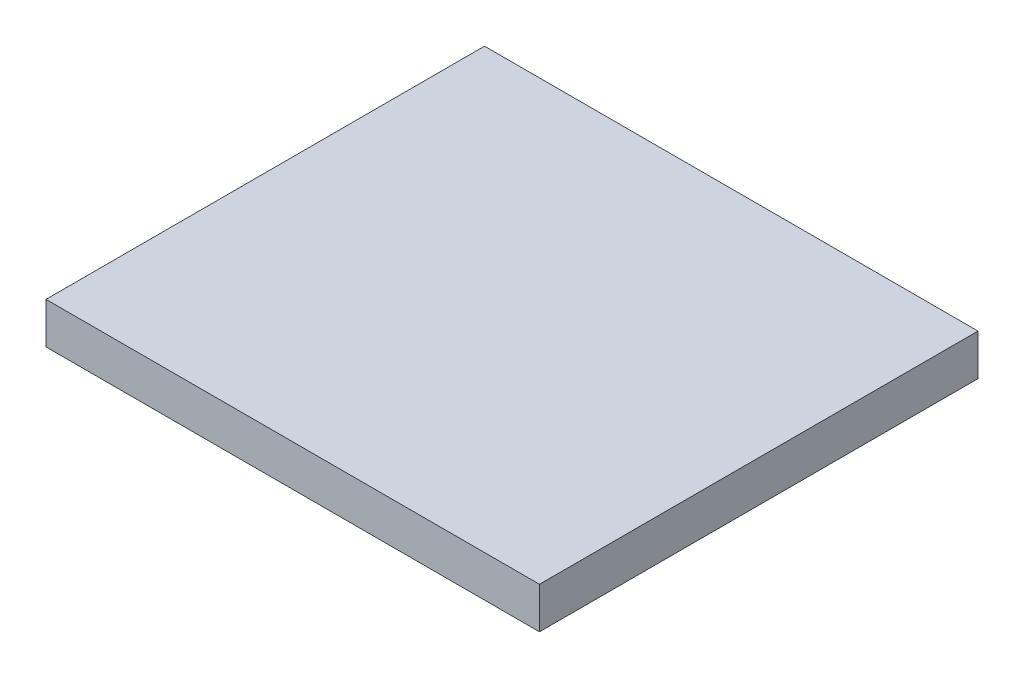
ISO-10303-21;
HEADER;
FILE_DESCRIPTION(('STEP AP214'),'2;1');
FILE_NAME('part.step','',(''),(''),'','','');
FILE_SCHEMA(('AUTOMOTIVE_DESIGN { 1 0 10303 214 1 1 1 1 }'));
ENDSEC;
DATA;
#1=APPLICATION_CONTEXT('core data for automotive mechanical design processes');
#2=APPLICATION_PROTOCOL_DEFINITION('international standard','automotive_design',2000,#1);
#3=PRODUCT_CONTEXT('',#1,'mechanical');
#4=PRODUCT('Part','Part','',(#3));
#5=PRODUCT_RELATED_PRODUCT_CATEGORY('part','',(#4));
#6=PRODUCT_DEFINITION_FORMATION('','',#4);
#7=PRODUCT_DEFINITION_CONTEXT('part definition',#1,'design');
#8=PRODUCT_DEFINITION('design','',#6,#7);
#9=PRODUCT_DEFINITION_SHAPE('','',#8);
#10=(LENGTH_UNIT() NAMED_UNIT(*) SI_UNIT(.MILLI.,.METRE.));
#11=(NAMED_UNIT(*) PLANE_ANGLE_UNIT() SI_UNIT($,.RADIAN.));
#12=(NAMED_UNIT(*) SI_UNIT($,.STERADIAN.) SOLID_ANGLE_UNIT());
#13=UNCERTAINTY_MEASURE_WITH_UNIT(LENGTH_MEASURE(1.E-05),#10,'distance_accuracy_value','');
#14=(GEOMETRIC_REPRESENTATION_CONTEXT(3) GLOBAL_UNCERTAINTY_ASSIGNED_CONTEXT((#13)) GLOBAL_UNIT_ASSIGNED_CONTEXT((#10,
#11,#12)) REPRESENTATION_CONTEXT('',''));
#15=CARTESIAN_POINT('',(0.,0.,0.));
#16=DIRECTION('',(0.,0.,1.));
#17=DIRECTION('',(1.,0.,0.));
#18=AXIS2_PLACEMENT_3D('',#15,#16,#17);
#19=CARTESIAN_POINT('',(2737.612,457.2,2432.812));
#20=DIRECTION('',(-1.,0.,0.));
#21=DIRECTION('',(0.,0.,1.));
#22=AXIS2_PLACEMENT_3D('',#19,#20,#21);
#23=PLANE('',#22);
#24=DIRECTION('',(0.,0.,-1.));
#25=VECTOR('',#24,1.);
#26=CARTESIAN_POINT('',(2737.612,0.,2432.812));
#27=LINE('',#26,#25);
#28=CARTESIAN_POINT('',(2737.612,0.,2432.812));
#29=VERTEX_POINT('',#28);
#30=CARTESIAN_POINT('',(2737.612,0.,-2432.812));
#31=VERTEX_POINT('',#30);
#32=EDGE_CURVE('E102',#29,#31,#27,.T.);
#33=ORIENTED_EDGE('',*,*,#32,.T.);
#34=DIRECTION('',(0.,-1.,0.));
#35=VECTOR('',#34,1.);
#36=CARTESIAN_POINT('',(2737.612,457.2,-2432.812));
#37=LINE('',#36,#35);
#38=CARTESIAN_POINT('',(2737.612,457.2,-2432.812));
#39=VERTEX_POINT('',#38);
#40=EDGE_CURVE('E11',#39,#31,#37,.T.);
#41=ORIENTED_EDGE('',*,*,#40,.F.);
#42=DIRECTION('',(0.,0.,-1.));
#43=VECTOR('',#42,1.);
#44=CARTESIAN_POINT('',(2737.612,457.2,2432.812));
#45=LINE('',#44,#43);
#46=CARTESIAN_POINT('',(2737.612,457.2,2432.812));
#47=VERTEX_POINT('',#46);
#48=EDGE_CURVE('E90',#47,#39,#45,.T.);
#49=ORIENTED_EDGE('',*,*,#48,.F.);
#50=DIRECTION('',(0.,-1.,0.));
#51=VECTOR('',#50,1.);
#52=CARTESIAN_POINT('',(2737.612,457.2,2432.812));
#53=LINE('',#52,#51);
#54=EDGE_CURVE('E98',#47,#29,#53,.T.);
#55=ORIENTED_EDGE('',*,*,#54,.T.);
#56=EDGE_LOOP('',(#33,#41,#49,#55));
#57=FACE_BOUND('',#56,.T.);
#58=ADVANCED_FACE('F39',(#57),#23,.F.);
#59=CARTESIAN_POINT('',(-2737.612,457.2,-2432.812));
#60=DIRECTION('',(0.,0.,1.));
#61=DIRECTION('',(1.,0.,0.));
#62=AXIS2_PLACEMENT_3D('',#59,#60,#61);
#63=PLANE('',#62);
#64=DIRECTION('',(-1.,0.,0.));
#65=VECTOR('',#64,1.);
#66=CARTESIAN_POINT('',(-2737.612,0.,-2432.812));
#67=LINE('',#66,#65);
#68=CARTESIAN_POINT('',(-2737.612,0.,-2432.812));
#69=VERTEX_POINT('',#68);
#70=EDGE_CURVE('E94',#31,#69,#67,.T.);
#71=ORIENTED_EDGE('',*,*,#70,.T.);
#72=DIRECTION('',(0.,-1.,0.));
#73=VECTOR('',#72,1.);
#74=CARTESIAN_POINT('',(-2737.612,457.2,-2432.812));
#75=LINE('',#74,#73);
#76=CARTESIAN_POINT('',(-2737.612,457.2,-2432.812));
#77=VERTEX_POINT('',#76);
#78=EDGE_CURVE('E47',#77,#69,#75,.T.);
#79=ORIENTED_EDGE('',*,*,#78,.F.);
#80=DIRECTION('',(-1.,0.,0.));
#81=VECTOR('',#80,1.);
#82=CARTESIAN_POINT('',(-2737.612,457.2,-2432.812));
#83=LINE('',#82,#81);
#84=EDGE_CURVE('E85',#39,#77,#83,.T.);
#85=ORIENTED_EDGE('',*,*,#84,.F.);
#86=ORIENTED_EDGE('',*,*,#40,.T.);
#87=EDGE_LOOP('',(#71,#79,#85,#86));
#88=FACE_BOUND('',#87,.T.);
#89=ADVANCED_FACE('F93',(#88),#63,.F.);
#90=CARTESIAN_POINT('',(-2737.612,457.2,2432.812));
#91=DIRECTION('',(1.,0.,0.));
#92=DIRECTION('',(0.,0.,-1.));
#93=AXIS2_PLACEMENT_3D('',#90,#91,#92);
#94=PLANE('',#93);
#95=DIRECTION('',(0.,0.,1.));
#96=VECTOR('',#95,1.);
#97=CARTESIAN_POINT('',(-2737.612,0.,2432.812));
#98=LINE('',#97,#96);
#99=CARTESIAN_POINT('',(-2737.612,0.,2432.812));
#100=VERTEX_POINT('',#99);
#101=EDGE_CURVE('E72',#69,#100,#98,.T.);
#102=ORIENTED_EDGE('',*,*,#101,.T.);
#103=DIRECTION('',(0.,-1.,0.));
#104=VECTOR('',#103,1.);
#105=CARTESIAN_POINT('',(-2737.612,457.2,2432.812));
#106=LINE('',#105,#104);
#107=CARTESIAN_POINT('',(-2737.612,457.2,2432.812));
#108=VERTEX_POINT('',#107);
#109=EDGE_CURVE('E95',#108,#100,#106,.T.);
#110=ORIENTED_EDGE('',*,*,#109,.F.);
#111=DIRECTION('',(0.,0.,1.));
#112=VECTOR('',#111,1.);
#113=CARTESIAN_POINT('',(-2737.612,457.2,2432.812));
#114=LINE('',#113,#112);
#115=EDGE_CURVE('E88',#77,#108,#114,.T.);
#116=ORIENTED_EDGE('',*,*,#115,.F.);
#117=ORIENTED_EDGE('',*,*,#78,.T.);
#118=EDGE_LOOP('',(#102,#110,#116,#117));
#119=FACE_BOUND('',#118,.T.);
#120=ADVANCED_FACE('F96',(#119),#94,.F.);
#121=CARTESIAN_POINT('',(-2737.612,457.2,2432.812));
#122=DIRECTION('',(0.,0.,-1.));
#123=DIRECTION('',(-1.,0.,0.));
#124=AXIS2_PLACEMENT_3D('',#121,#122,#123);
#125=PLANE('',#124);
#126=DIRECTION('',(1.,0.,0.));
#127=VECTOR('',#126,1.);
#128=CARTESIAN_POINT('',(-2737.612,0.,2432.812));
#129=LINE('',#128,#127);
#130=EDGE_CURVE('E78',#100,#29,#129,.T.);
#131=ORIENTED_EDGE('',*,*,#130,.T.);
#132=ORIENTED_EDGE('',*,*,#54,.F.);
#133=DIRECTION('',(1.,0.,0.));
#134=VECTOR('',#133,1.);
#135=CARTESIAN_POINT('',(-2737.612,457.2,2432.812));
#136=LINE('',#135,#134);
#137=EDGE_CURVE('E55',#108,#47,#136,.T.);
#138=ORIENTED_EDGE('',*,*,#137,.F.);
#139=ORIENTED_EDGE('',*,*,#109,.T.);
#140=EDGE_LOOP('',(#131,#132,#138,#139));
#141=FACE_BOUND('',#140,.T.);
#142=ADVANCED_FACE('F109',(#141),#125,.F.);
#143=CARTESIAN_POINT('',(0.,457.2,0.));
#144=DIRECTION('',(0.,-1.,0.));
#145=DIRECTION('',(0.,0.,-1.));
#146=AXIS2_PLACEMENT_3D('',#143,#144,#145);
#147=PLANE('',#146);
#148=ORIENTED_EDGE('',*,*,#48,.T.);
#149=ORIENTED_EDGE('',*,*,#84,.T.);
#150=ORIENTED_EDGE('',*,*,#115,.T.);
#151=ORIENTED_EDGE('',*,*,#137,.T.);
#152=EDGE_LOOP('',(#148,#149,#150,#151));
#153=FACE_BOUND('',#152,.T.);
#154=ADVANCED_FACE('F86',(#153),#147,.F.);
#155=CARTESIAN_POINT('',(0.,0.,0.));
#156=DIRECTION('',(0.,-1.,0.));
#157=DIRECTION('',(0.,0.,-1.));
#158=AXIS2_PLACEMENT_3D('',#155,#156,#157);
#159=PLANE('',#158);
#160=ORIENTED_EDGE('',*,*,#32,.F.);
#161=ORIENTED_EDGE('',*,*,#130,.F.);
#162=ORIENTED_EDGE('',*,*,#101,.F.);
#163=ORIENTED_EDGE('',*,*,#70,.F.);
#164=EDGE_LOOP('',(#160,#161,#162,#163));
#165=FACE_BOUND('',#164,.T.);
#166=ADVANCED_FACE('F112',(#165),#159,.T.);
#167=CLOSED_SHELL('',(#58,#89,#120,#142,#154,#166));
#168=MANIFOLD_SOLID_BREP('B2',#167);
#169=ADVANCED_BREP_SHAPE_REPRESENTATION('',(#18,#168),#14);
#170=SHAPE_DEFINITION_REPRESENTATION(#9,#169);
ENDSEC;
END-ISO-10303-21;
